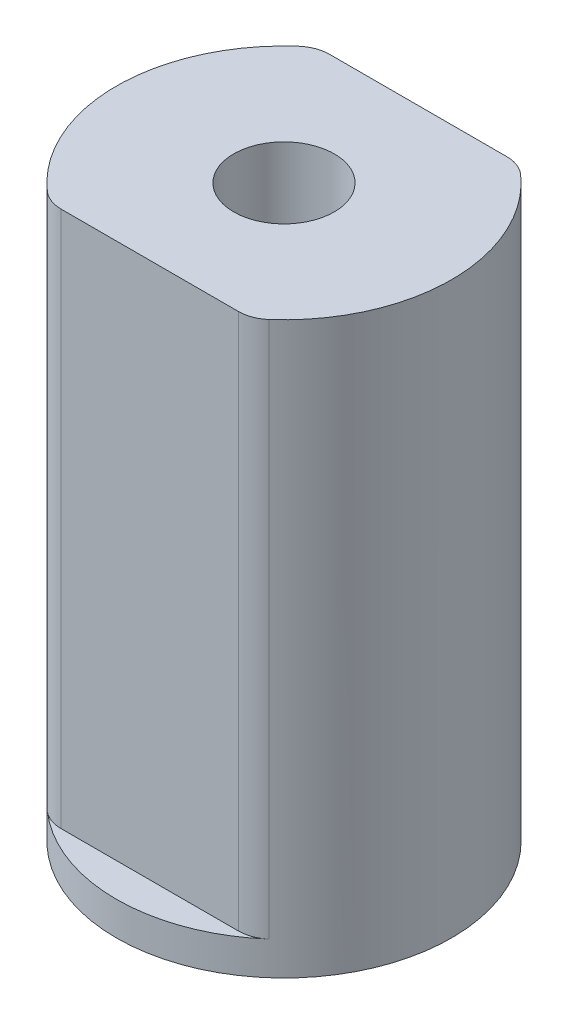
ISO-10303-21;
HEADER;
FILE_DESCRIPTION(('STEP AP214'),'2;1');
FILE_NAME('part.step','',(''),(''),'','','');
FILE_SCHEMA(('AUTOMOTIVE_DESIGN { 1 0 10303 214 1 1 1 1 }'));
ENDSEC;
DATA;
#1=APPLICATION_CONTEXT('core data for automotive mechanical design processes');
#2=APPLICATION_PROTOCOL_DEFINITION('international standard','automotive_design',2000,#1);
#3=PRODUCT_CONTEXT('',#1,'mechanical');
#4=PRODUCT('Part','Part','',(#3));
#5=PRODUCT_RELATED_PRODUCT_CATEGORY('part','',(#4));
#6=PRODUCT_DEFINITION_FORMATION('','',#4);
#7=PRODUCT_DEFINITION_CONTEXT('part definition',#1,'design');
#8=PRODUCT_DEFINITION('design','',#6,#7);
#9=PRODUCT_DEFINITION_SHAPE('','',#8);
#10=(LENGTH_UNIT() NAMED_UNIT(*) SI_UNIT(.MILLI.,.METRE.));
#11=(NAMED_UNIT(*) PLANE_ANGLE_UNIT() SI_UNIT($,.RADIAN.));
#12=(NAMED_UNIT(*) SI_UNIT($,.STERADIAN.) SOLID_ANGLE_UNIT());
#13=UNCERTAINTY_MEASURE_WITH_UNIT(LENGTH_MEASURE(1.E-05),#10,'distance_accuracy_value','');
#14=(GEOMETRIC_REPRESENTATION_CONTEXT(3) GLOBAL_UNCERTAINTY_ASSIGNED_CONTEXT((#13)) GLOBAL_UNIT_ASSIGNED_CONTEXT((#10,
#11,#12)) REPRESENTATION_CONTEXT('',''));
#15=CARTESIAN_POINT('',(0.,0.,0.));
#16=DIRECTION('',(0.,0.,1.));
#17=DIRECTION('',(1.,0.,0.));
#18=AXIS2_PLACEMENT_3D('',#15,#16,#17);
#19=CARTESIAN_POINT('',(0.,0.5,0.));
#20=DIRECTION('',(0.,1.,0.));
#21=DIRECTION('',(0.,0.,1.));
#22=AXIS2_PLACEMENT_3D('',#19,#20,#21);
#23=PLANE('',#22);
#24=CARTESIAN_POINT('',(0.,0.5,0.));
#25=DIRECTION('',(0.,1.,0.));
#26=DIRECTION('',(0.,0.,1.));
#27=AXIS2_PLACEMENT_3D('',#24,#25,#26);
#28=CIRCLE('',#27,2.5);
#29=CARTESIAN_POINT('',(1.65359456941537,0.5,-1.875));
#30=VERTEX_POINT('',#29);
#31=CARTESIAN_POINT('',(-1.65359456941537,0.5,-1.875));
#32=VERTEX_POINT('',#31);
#33=EDGE_CURVE('E143',#30,#32,#28,.T.);
#34=ORIENTED_EDGE('',*,*,#33,.T.);
#35=CARTESIAN_POINT('',(-1.3228756555323,0.5,-1.5));
#36=DIRECTION('',(0.,1.,0.));
#37=DIRECTION('',(0.,0.,1.));
#38=AXIS2_PLACEMENT_3D('',#35,#36,#37);
#39=CIRCLE('',#38,0.5);
#40=CARTESIAN_POINT('',(-1.3228756555323,0.5,-2.));
#41=VERTEX_POINT('',#40);
#42=EDGE_CURVE('E177',#32,#41,#39,.F.);
#43=ORIENTED_EDGE('',*,*,#42,.T.);
#44=DIRECTION('',(1.,0.,0.));
#45=VECTOR('',#44,1.);
#46=CARTESIAN_POINT('',(0.,0.5,-2.));
#47=LINE('',#46,#45);
#48=CARTESIAN_POINT('',(1.3228756555323,0.5,-2.));
#49=VERTEX_POINT('',#48);
#50=EDGE_CURVE('E151',#41,#49,#47,.T.);
#51=ORIENTED_EDGE('',*,*,#50,.T.);
#52=CARTESIAN_POINT('',(1.3228756555323,0.5,-1.5));
#53=DIRECTION('',(0.,1.,0.));
#54=DIRECTION('',(0.,0.,1.));
#55=AXIS2_PLACEMENT_3D('',#52,#53,#54);
#56=CIRCLE('',#55,0.5);
#57=EDGE_CURVE('E179',#49,#30,#56,.F.);
#58=ORIENTED_EDGE('',*,*,#57,.T.);
#59=EDGE_LOOP('',(#34,#43,#51,#58));
#60=FACE_BOUND('',#59,.T.);
#61=ADVANCED_FACE('F41',(#60),#23,.T.);
#62=CARTESIAN_POINT('',(0.,0.5,0.));
#63=DIRECTION('',(0.,-1.,0.));
#64=DIRECTION('',(0.,0.,-1.));
#65=AXIS2_PLACEMENT_3D('',#62,#63,#64);
#66=CYLINDRICAL_SURFACE('',#65,2.5);
#67=CARTESIAN_POINT('',(0.,8.5,0.));
#68=DIRECTION('',(0.,1.,0.));
#69=DIRECTION('',(0.,0.,1.));
#70=AXIS2_PLACEMENT_3D('',#67,#68,#69);
#71=CIRCLE('',#70,2.5);
#72=CARTESIAN_POINT('',(-1.65359456941537,8.5,-1.875));
#73=VERTEX_POINT('',#72);
#74=CARTESIAN_POINT('',(-1.65359456941537,8.5,1.875));
#75=VERTEX_POINT('',#74);
#76=EDGE_CURVE('E134',#73,#75,#71,.T.);
#77=ORIENTED_EDGE('',*,*,#76,.F.);
#78=DIRECTION('',(0.,-1.,0.));
#79=VECTOR('',#78,1.);
#80=CARTESIAN_POINT('',(-1.65359456941537,0.5,-1.875));
#81=LINE('',#80,#79);
#82=EDGE_CURVE('E141',#73,#32,#81,.T.);
#83=ORIENTED_EDGE('',*,*,#82,.T.);
#84=ORIENTED_EDGE('',*,*,#33,.F.);
#85=DIRECTION('',(0.,-1.,0.));
#86=VECTOR('',#85,1.);
#87=CARTESIAN_POINT('',(1.65359456941537,0.5,-1.875));
#88=LINE('',#87,#86);
#89=CARTESIAN_POINT('',(1.65359456941537,8.5,-1.875));
#90=VERTEX_POINT('',#89);
#91=EDGE_CURVE('E130',#30,#90,#88,.F.);
#92=ORIENTED_EDGE('',*,*,#91,.T.);
#93=CARTESIAN_POINT('',(1.65359456941537,8.5,1.875));
#94=VERTEX_POINT('',#93);
#95=EDGE_CURVE('E112',#94,#90,#71,.T.);
#96=ORIENTED_EDGE('',*,*,#95,.F.);
#97=DIRECTION('',(0.,-1.,0.));
#98=VECTOR('',#97,1.);
#99=CARTESIAN_POINT('',(1.65359456941537,0.5,1.875));
#100=LINE('',#99,#98);
#101=CARTESIAN_POINT('',(1.65359456941537,0.5,1.875));
#102=VERTEX_POINT('',#101);
#103=EDGE_CURVE('E128',#94,#102,#100,.T.);
#104=ORIENTED_EDGE('',*,*,#103,.T.);
#105=CARTESIAN_POINT('',(-1.65359456941537,0.5,1.875));
#106=VERTEX_POINT('',#105);
#107=EDGE_CURVE('E168',#106,#102,#28,.T.);
#108=ORIENTED_EDGE('',*,*,#107,.F.);
#109=DIRECTION('',(0.,-1.,0.));
#110=VECTOR('',#109,1.);
#111=CARTESIAN_POINT('',(-1.65359456941537,0.5,1.875));
#112=LINE('',#111,#110);
#113=EDGE_CURVE('E137',#106,#75,#112,.F.);
#114=ORIENTED_EDGE('',*,*,#113,.T.);
#115=EDGE_LOOP('',(#77,#83,#84,#92,#96,#104,#108,#114));
#116=FACE_BOUND('',#115,.T.);
#117=CARTESIAN_POINT('',(0.,0.,0.));
#118=DIRECTION('',(0.,1.,0.));
#119=DIRECTION('',(0.,0.,1.));
#120=AXIS2_PLACEMENT_3D('',#117,#118,#119);
#121=CIRCLE('',#120,2.5);
#122=CARTESIAN_POINT('',(0.,0.,2.5));
#123=VERTEX_POINT('',#122);
#124=EDGE_CURVE('E164',#123,#123,#121,.T.);
#125=ORIENTED_EDGE('',*,*,#124,.T.);
#126=EDGE_LOOP('',(#125));
#127=FACE_BOUND('',#126,.T.);
#128=ADVANCED_FACE('F126',(#116,#127),#66,.T.);
#129=DIRECTION('',(1.,0.,0.));
#130=VECTOR('',#129,1.);
#131=CARTESIAN_POINT('',(0.,0.5,2.));
#132=LINE('',#131,#130);
#133=CARTESIAN_POINT('',(-1.3228756555323,0.5,2.));
#134=VERTEX_POINT('',#133);
#135=CARTESIAN_POINT('',(1.3228756555323,0.5,2.));
#136=VERTEX_POINT('',#135);
#137=EDGE_CURVE('E157',#134,#136,#132,.T.);
#138=ORIENTED_EDGE('',*,*,#137,.F.);
#139=CARTESIAN_POINT('',(-1.3228756555323,0.5,1.5));
#140=DIRECTION('',(0.,1.,0.));
#141=DIRECTION('',(0.,0.,1.));
#142=AXIS2_PLACEMENT_3D('',#139,#140,#141);
#143=CIRCLE('',#142,0.5);
#144=EDGE_CURVE('E11',#134,#106,#143,.F.);
#145=ORIENTED_EDGE('',*,*,#144,.T.);
#146=ORIENTED_EDGE('',*,*,#107,.T.);
#147=CARTESIAN_POINT('',(1.3228756555323,0.5,1.5));
#148=DIRECTION('',(0.,1.,0.));
#149=DIRECTION('',(0.,0.,1.));
#150=AXIS2_PLACEMENT_3D('',#147,#148,#149);
#151=CIRCLE('',#150,0.5);
#152=EDGE_CURVE('E50',#102,#136,#151,.F.);
#153=ORIENTED_EDGE('',*,*,#152,.T.);
#154=EDGE_LOOP('',(#138,#145,#146,#153));
#155=FACE_BOUND('',#154,.T.);
#156=ADVANCED_FACE('F241',(#155),#23,.T.);
#157=CARTESIAN_POINT('',(0.,0.,0.));
#158=DIRECTION('',(0.,1.,0.));
#159=DIRECTION('',(0.,0.,1.));
#160=AXIS2_PLACEMENT_3D('',#157,#158,#159);
#161=PLANE('',#160);
#162=ORIENTED_EDGE('',*,*,#124,.F.);
#163=EDGE_LOOP('',(#162));
#164=FACE_BOUND('',#163,.T.);
#165=ADVANCED_FACE('F249',(#164),#161,.F.);
#166=CARTESIAN_POINT('',(0.,8.5,2.));
#167=DIRECTION('',(0.,0.,-1.));
#168=DIRECTION('',(-1.,0.,0.));
#169=AXIS2_PLACEMENT_3D('',#166,#167,#168);
#170=PLANE('',#169);
#171=ORIENTED_EDGE('',*,*,#137,.T.);
#172=DIRECTION('',(0.,-1.,0.));
#173=VECTOR('',#172,1.);
#174=CARTESIAN_POINT('',(1.3228756555323,8.5,2.));
#175=LINE('',#174,#173);
#176=CARTESIAN_POINT('',(1.3228756555323,8.5,2.));
#177=VERTEX_POINT('',#176);
#178=EDGE_CURVE('E187',#136,#177,#175,.F.);
#179=ORIENTED_EDGE('',*,*,#178,.T.);
#180=DIRECTION('',(1.,0.,0.));
#181=VECTOR('',#180,1.);
#182=CARTESIAN_POINT('',(0.,8.5,2.));
#183=LINE('',#182,#181);
#184=CARTESIAN_POINT('',(-1.3228756555323,8.5,2.));
#185=VERTEX_POINT('',#184);
#186=EDGE_CURVE('E115',#185,#177,#183,.T.);
#187=ORIENTED_EDGE('',*,*,#186,.F.);
#188=DIRECTION('',(0.,-1.,0.));
#189=VECTOR('',#188,1.);
#190=CARTESIAN_POINT('',(-1.3228756555323,8.5,2.));
#191=LINE('',#190,#189);
#192=EDGE_CURVE('E212',#185,#134,#191,.T.);
#193=ORIENTED_EDGE('',*,*,#192,.T.);
#194=EDGE_LOOP('',(#171,#179,#187,#193));
#195=FACE_BOUND('',#194,.T.);
#196=ADVANCED_FACE('F263',(#195),#170,.F.);
#197=CARTESIAN_POINT('',(0.,8.5,0.));
#198=DIRECTION('',(0.,-1.,0.));
#199=DIRECTION('',(0.,0.,-1.));
#200=AXIS2_PLACEMENT_3D('',#197,#198,#199);
#201=CYLINDRICAL_SURFACE('',#200,0.75);
#202=CARTESIAN_POINT('',(0.,8.5,0.));
#203=DIRECTION('',(0.,1.,0.));
#204=DIRECTION('',(0.,0.,1.));
#205=AXIS2_PLACEMENT_3D('',#202,#203,#204);
#206=CIRCLE('',#205,0.75);
#207=CARTESIAN_POINT('',(0.,8.5,0.75));
#208=VERTEX_POINT('',#207);
#209=EDGE_CURVE('E156',#208,#208,#206,.T.);
#210=ORIENTED_EDGE('',*,*,#209,.T.);
#211=EDGE_LOOP('',(#210));
#212=FACE_BOUND('',#211,.T.);
#213=CARTESIAN_POINT('',(0.,0.5,0.));
#214=DIRECTION('',(0.,1.,0.));
#215=DIRECTION('',(0.,0.,1.));
#216=AXIS2_PLACEMENT_3D('',#213,#214,#215);
#217=CIRCLE('',#216,0.75);
#218=CARTESIAN_POINT('',(0.,0.5,0.75));
#219=VERTEX_POINT('',#218);
#220=EDGE_CURVE('E200',#219,#219,#217,.T.);
#221=ORIENTED_EDGE('',*,*,#220,.F.);
#222=EDGE_LOOP('',(#221));
#223=FACE_BOUND('',#222,.T.);
#224=ADVANCED_FACE('F259',(#212,#223),#201,.F.);
#225=CARTESIAN_POINT('',(0.,8.5,-2.));
#226=DIRECTION('',(0.,0.,-1.));
#227=DIRECTION('',(-1.,0.,0.));
#228=AXIS2_PLACEMENT_3D('',#225,#226,#227);
#229=PLANE('',#228);
#230=ORIENTED_EDGE('',*,*,#50,.F.);
#231=DIRECTION('',(0.,1.,0.));
#232=VECTOR('',#231,1.);
#233=CARTESIAN_POINT('',(-1.3228756555323,8.5,-2.));
#234=LINE('',#233,#232);
#235=CARTESIAN_POINT('',(-1.3228756555323,8.5,-2.));
#236=VERTEX_POINT('',#235);
#237=EDGE_CURVE('E185',#41,#236,#234,.T.);
#238=ORIENTED_EDGE('',*,*,#237,.T.);
#239=DIRECTION('',(1.,0.,0.));
#240=VECTOR('',#239,1.);
#241=CARTESIAN_POINT('',(0.,8.5,-2.));
#242=LINE('',#241,#240);
#243=CARTESIAN_POINT('',(1.3228756555323,8.5,-2.));
#244=VERTEX_POINT('',#243);
#245=EDGE_CURVE('E132',#236,#244,#242,.T.);
#246=ORIENTED_EDGE('',*,*,#245,.T.);
#247=DIRECTION('',(0.,1.,0.));
#248=VECTOR('',#247,1.);
#249=CARTESIAN_POINT('',(1.3228756555323,0.5,-2.));
#250=LINE('',#249,#248);
#251=EDGE_CURVE('E150',#244,#49,#250,.F.);
#252=ORIENTED_EDGE('',*,*,#251,.T.);
#253=EDGE_LOOP('',(#230,#238,#246,#252));
#254=FACE_BOUND('',#253,.T.);
#255=ADVANCED_FACE('F228',(#254),#229,.T.);
#256=CARTESIAN_POINT('',(0.,8.5,0.));
#257=DIRECTION('',(0.,1.,0.));
#258=DIRECTION('',(0.,0.,1.));
#259=AXIS2_PLACEMENT_3D('',#256,#257,#258);
#260=PLANE('',#259);
#261=ORIENTED_EDGE('',*,*,#209,.F.);
#262=EDGE_LOOP('',(#261));
#263=FACE_BOUND('',#262,.T.);
#264=ORIENTED_EDGE('',*,*,#245,.F.);
#265=CARTESIAN_POINT('',(-1.3228756555323,8.5,-1.5));
#266=DIRECTION('',(0.,1.,0.));
#267=DIRECTION('',(0.,0.,1.));
#268=AXIS2_PLACEMENT_3D('',#265,#266,#267);
#269=CIRCLE('',#268,0.5);
#270=EDGE_CURVE('E210',#236,#73,#269,.T.);
#271=ORIENTED_EDGE('',*,*,#270,.T.);
#272=ORIENTED_EDGE('',*,*,#76,.T.);
#273=CARTESIAN_POINT('',(-1.3228756555323,8.5,1.5));
#274=DIRECTION('',(0.,1.,0.));
#275=DIRECTION('',(0.,0.,1.));
#276=AXIS2_PLACEMENT_3D('',#273,#274,#275);
#277=CIRCLE('',#276,0.5);
#278=EDGE_CURVE('E121',#75,#185,#277,.T.);
#279=ORIENTED_EDGE('',*,*,#278,.T.);
#280=ORIENTED_EDGE('',*,*,#186,.T.);
#281=CARTESIAN_POINT('',(1.3228756555323,8.5,1.5));
#282=DIRECTION('',(0.,1.,0.));
#283=DIRECTION('',(0.,0.,1.));
#284=AXIS2_PLACEMENT_3D('',#281,#282,#283);
#285=CIRCLE('',#284,0.5);
#286=EDGE_CURVE('E108',#177,#94,#285,.T.);
#287=ORIENTED_EDGE('',*,*,#286,.T.);
#288=ORIENTED_EDGE('',*,*,#95,.T.);
#289=CARTESIAN_POINT('',(1.3228756555323,8.5,-1.5));
#290=DIRECTION('',(0.,1.,0.));
#291=DIRECTION('',(0.,0.,1.));
#292=AXIS2_PLACEMENT_3D('',#289,#290,#291);
#293=CIRCLE('',#292,0.5);
#294=EDGE_CURVE('E120',#90,#244,#293,.T.);
#295=ORIENTED_EDGE('',*,*,#294,.T.);
#296=EDGE_LOOP('',(#264,#271,#272,#279,#280,#287,#288,#295));
#297=FACE_BOUND('',#296,.T.);
#298=ADVANCED_FACE('F111',(#263,#297),#260,.T.);
#299=ORIENTED_EDGE('',*,*,#220,.T.);
#300=EDGE_LOOP('',(#299));
#301=FACE_BOUND('',#300,.T.);
#302=ADVANCED_FACE('F237',(#301),#23,.T.);
#303=CARTESIAN_POINT('',(-1.3228756555323,0.5,-1.5));
#304=DIRECTION('',(0.,-1.,0.));
#305=DIRECTION('',(0.,0.,-1.));
#306=AXIS2_PLACEMENT_3D('',#303,#304,#305);
#307=CYLINDRICAL_SURFACE('',#306,0.5);
#308=ORIENTED_EDGE('',*,*,#270,.F.);
#309=ORIENTED_EDGE('',*,*,#237,.F.);
#310=ORIENTED_EDGE('',*,*,#42,.F.);
#311=ORIENTED_EDGE('',*,*,#82,.F.);
#312=EDGE_LOOP('',(#308,#309,#310,#311));
#313=FACE_BOUND('',#312,.T.);
#314=ADVANCED_FACE('F184',(#313),#307,.T.);
#315=CARTESIAN_POINT('',(1.3228756555323,0.5,-1.5));
#316=DIRECTION('',(0.,-1.,0.));
#317=DIRECTION('',(0.,0.,-1.));
#318=AXIS2_PLACEMENT_3D('',#315,#316,#317);
#319=CYLINDRICAL_SURFACE('',#318,0.5);
#320=ORIENTED_EDGE('',*,*,#294,.F.);
#321=ORIENTED_EDGE('',*,*,#91,.F.);
#322=ORIENTED_EDGE('',*,*,#57,.F.);
#323=ORIENTED_EDGE('',*,*,#251,.F.);
#324=EDGE_LOOP('',(#320,#321,#322,#323));
#325=FACE_BOUND('',#324,.T.);
#326=ADVANCED_FACE('F230',(#325),#319,.T.);
#327=CARTESIAN_POINT('',(1.3228756555323,0.5,1.5));
#328=DIRECTION('',(0.,-1.,0.));
#329=DIRECTION('',(0.,0.,-1.));
#330=AXIS2_PLACEMENT_3D('',#327,#328,#329);
#331=CYLINDRICAL_SURFACE('',#330,0.5);
#332=ORIENTED_EDGE('',*,*,#286,.F.);
#333=ORIENTED_EDGE('',*,*,#178,.F.);
#334=ORIENTED_EDGE('',*,*,#152,.F.);
#335=ORIENTED_EDGE('',*,*,#103,.F.);
#336=EDGE_LOOP('',(#332,#333,#334,#335));
#337=FACE_BOUND('',#336,.T.);
#338=ADVANCED_FACE('F135',(#337),#331,.T.);
#339=CARTESIAN_POINT('',(-1.3228756555323,0.5,1.5));
#340=DIRECTION('',(0.,-1.,0.));
#341=DIRECTION('',(0.,0.,-1.));
#342=AXIS2_PLACEMENT_3D('',#339,#340,#341);
#343=CYLINDRICAL_SURFACE('',#342,0.5);
#344=ORIENTED_EDGE('',*,*,#278,.F.);
#345=ORIENTED_EDGE('',*,*,#113,.F.);
#346=ORIENTED_EDGE('',*,*,#144,.F.);
#347=ORIENTED_EDGE('',*,*,#192,.F.);
#348=EDGE_LOOP('',(#344,#345,#346,#347));
#349=FACE_BOUND('',#348,.T.);
#350=ADVANCED_FACE('F43',(#349),#343,.T.);
#351=CLOSED_SHELL('',(#61,#128,#156,#165,#196,#224,#255,#298,#302,#314,#326,#338,#350));
#352=MANIFOLD_SOLID_BREP('B2',#351);
#353=ADVANCED_BREP_SHAPE_REPRESENTATION('',(#18,#352),#14);
#354=SHAPE_DEFINITION_REPRESENTATION(#9,#353);
ENDSEC;
END-ISO-10303-21;
